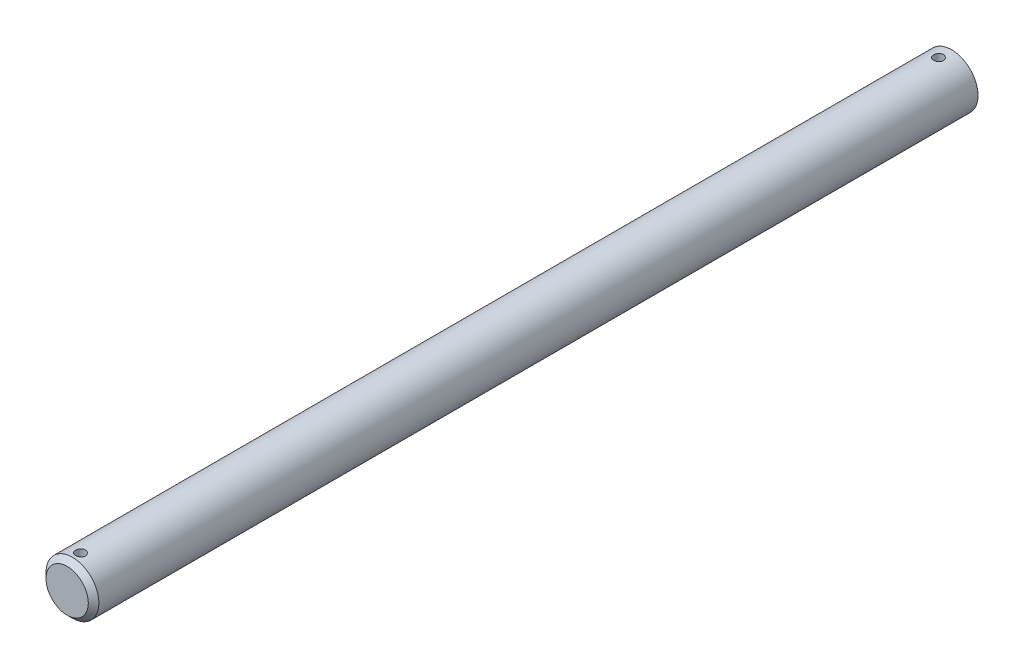
ISO-10303-21;
HEADER;
FILE_DESCRIPTION(('STEP AP214'),'2;1');
FILE_NAME('part.step','',(''),(''),'','','');
FILE_SCHEMA(('AUTOMOTIVE_DESIGN { 1 0 10303 214 1 1 1 1 }'));
ENDSEC;
DATA;
#1=APPLICATION_CONTEXT('core data for automotive mechanical design processes');
#2=APPLICATION_PROTOCOL_DEFINITION('international standard','automotive_design',2000,#1);
#3=PRODUCT_CONTEXT('',#1,'mechanical');
#4=PRODUCT('Part','Part','',(#3));
#5=PRODUCT_RELATED_PRODUCT_CATEGORY('part','',(#4));
#6=PRODUCT_DEFINITION_FORMATION('','',#4);
#7=PRODUCT_DEFINITION_CONTEXT('part definition',#1,'design');
#8=PRODUCT_DEFINITION('design','',#6,#7);
#9=PRODUCT_DEFINITION_SHAPE('','',#8);
#10=(LENGTH_UNIT() NAMED_UNIT(*) SI_UNIT(.MILLI.,.METRE.));
#11=(NAMED_UNIT(*) PLANE_ANGLE_UNIT() SI_UNIT($,.RADIAN.));
#12=(NAMED_UNIT(*) SI_UNIT($,.STERADIAN.) SOLID_ANGLE_UNIT());
#13=UNCERTAINTY_MEASURE_WITH_UNIT(LENGTH_MEASURE(1.E-05),#10,'distance_accuracy_value','');
#14=(GEOMETRIC_REPRESENTATION_CONTEXT(3) GLOBAL_UNCERTAINTY_ASSIGNED_CONTEXT((#13)) GLOBAL_UNIT_ASSIGNED_CONTEXT((#10,
#11,#12)) REPRESENTATION_CONTEXT('',''));
#15=CARTESIAN_POINT('',(0.,0.,0.));
#16=DIRECTION('',(0.,0.,1.));
#17=DIRECTION('',(1.,0.,0.));
#18=AXIS2_PLACEMENT_3D('',#15,#16,#17);
#19=CARTESIAN_POINT('',(0.,0.,304.8));
#20=DIRECTION('',(0.,0.,-1.));
#21=DIRECTION('',(-1.,0.,0.));
#22=AXIS2_PLACEMENT_3D('',#19,#20,#21);
#23=CYLINDRICAL_SURFACE('',#22,3.175);
#24=CARTESIAN_POINT('',(0.,-3.17500000000001,200.7631875));
#25=CARTESIAN_POINT('',(0.0331278493784853,-3.17499940005936,200.763186234132));
#26=CARTESIAN_POINT('',(0.0662721689897604,-3.17447616437681,200.760412916467));
#27=CARTESIAN_POINT('',(0.131626820280967,-3.17243930650301,200.749400064437));
#28=CARTESIAN_POINT('',(0.163836339741668,-3.17092484847488,200.741155916777));
#29=CARTESIAN_POINT('',(0.226366769234936,-3.16707495697542,200.719462709188));
#30=CARTESIAN_POINT('',(0.256689356240747,-3.16474026510011,200.706018349808));
#31=CARTESIAN_POINT('',(0.314645664321685,-3.1595048514429,200.674319695721));
#32=CARTESIAN_POINT('',(0.34227960280819,-3.1566041754851,200.656065790371));
#33=CARTESIAN_POINT('',(0.394407912259924,-3.15051811645857,200.615034154574));
#34=CARTESIAN_POINT('',(0.418865429028266,-3.14733001333615,200.592210001647));
#35=CARTESIAN_POINT('',(0.463627811849754,-3.14104860763278,200.542785624206));
#36=CARTESIAN_POINT('',(0.483932379579184,-3.13795531187579,200.516185128654));
#37=CARTESIAN_POINT('',(0.519965775954875,-3.13218731275362,200.459702708681));
#38=CARTESIAN_POINT('',(0.535657115316883,-3.12951611636079,200.42979647803));
#39=CARTESIAN_POINT('',(0.561778643443757,-3.12493308056008,200.367713899289));
#40=CARTESIAN_POINT('',(0.572209285923864,-3.1230211756692,200.335537747243));
#41=CARTESIAN_POINT('',(0.587395056092022,-3.120200569874,200.270223017731));
#42=CARTESIAN_POINT('',(0.592214454824662,-3.11928051754792,200.237099883297));
#43=CARTESIAN_POINT('',(0.596240425878415,-3.11851356370003,200.170503350404));
#44=CARTESIAN_POINT('',(0.595447501537275,-3.11866656594196,200.137029983624));
#45=CARTESIAN_POINT('',(0.588323450296884,-3.12001809916009,200.07114881341));
#46=CARTESIAN_POINT('',(0.582065407796812,-3.12120283233474,200.038732782137));
#47=CARTESIAN_POINT('',(0.564303860103709,-3.12446266491103,199.975419033399));
#48=CARTESIAN_POINT('',(0.552800132013026,-3.12653780214715,199.944521380514));
#49=CARTESIAN_POINT('',(0.524802287242858,-3.13135905069247,199.884907618022));
#50=CARTESIAN_POINT('',(0.508278659956945,-3.13410911079899,199.856205700738));
#51=CARTESIAN_POINT('',(0.470730932942593,-3.13996773104909,199.801954373361));
#52=CARTESIAN_POINT('',(0.449706376466774,-3.14307632756161,199.776405283626));
#53=CARTESIAN_POINT('',(0.403359563188527,-3.14936188004891,199.728762595718));
#54=CARTESIAN_POINT('',(0.377974795254092,-3.15253914125163,199.706729803558));
#55=CARTESIAN_POINT('',(0.323837314723613,-3.15855900111739,199.667226220107));
#56=CARTESIAN_POINT('',(0.295084568364023,-3.16140159642489,199.649755474555));
#57=CARTESIAN_POINT('',(0.234963886209646,-3.16643757934512,199.619862953933));
#58=CARTESIAN_POINT('',(0.203592733389712,-3.16863015282216,199.607447503288));
#59=CARTESIAN_POINT('',(0.139159898923862,-3.17211275581705,199.588079481804));
#60=CARTESIAN_POINT('',(0.106098397260247,-3.17340288121049,199.581126330645));
#61=CARTESIAN_POINT('',(0.039746496621029,-3.17492205629787,199.57296491894));
#62=CARTESIAN_POINT('',(0.00646668626417092,-3.17516649268312,199.571673344612));
#63=CARTESIAN_POINT('',(-0.0598333703365869,-3.17460925115548,199.574648268445));
#64=CARTESIAN_POINT('',(-0.0928536292531546,-3.1738076246401,199.578914493529));
#65=CARTESIAN_POINT('',(-0.157432999370982,-3.17125791126725,199.592814648338));
#66=CARTESIAN_POINT('',(-0.189001503602658,-3.16951726067194,199.602406421507));
#67=CARTESIAN_POINT('',(-0.250082300755401,-3.16528387378086,199.626639777378));
#68=CARTESIAN_POINT('',(-0.279594453904929,-3.16279108642312,199.64128170294));
#69=CARTESIAN_POINT('',(-0.336080366506806,-3.157291557982,199.675384132113));
#70=CARTESIAN_POINT('',(-0.363022863065379,-3.1542794982553,199.694895543107));
#71=CARTESIAN_POINT('',(-0.41328114704562,-3.1480892694748,199.738114198266));
#72=CARTESIAN_POINT('',(-0.436596595436346,-3.14491108492986,199.761821834222));
#73=CARTESIAN_POINT('',(-0.479255517992199,-3.13869576292426,199.813137139068));
#74=CARTESIAN_POINT('',(-0.498542136242492,-3.1356610588829,199.840792416662));
#75=CARTESIAN_POINT('',(-0.532196179135609,-3.1301252865148,199.898999182233));
#76=CARTESIAN_POINT('',(-0.546563786592775,-3.12762419835761,199.929550562522));
#77=CARTESIAN_POINT('',(-0.569891360504024,-3.12345793983175,199.992537953562));
#78=CARTESIAN_POINT('',(-0.578877385529314,-3.12178874798387,200.024964035013));
#79=CARTESIAN_POINT('',(-0.591267071076003,-3.11946609009084,200.090899991438));
#80=CARTESIAN_POINT('',(-0.59467136141813,-3.11881250944861,200.124409743701));
#81=CARTESIAN_POINT('',(-0.595779868526291,-3.11860088672157,200.190992306541));
#82=CARTESIAN_POINT('',(-0.593573770795143,-3.11902560714799,200.224063602442));
#83=CARTESIAN_POINT('',(-0.583720477284628,-3.12088450886938,200.289355033124));
#84=CARTESIAN_POINT('',(-0.576073314010793,-3.12231868413375,200.321575172988));
#85=CARTESIAN_POINT('',(-0.555592803846083,-3.126027641217,200.384201436153));
#86=CARTESIAN_POINT('',(-0.542769168607849,-3.12830084823628,200.41461083469));
#87=CARTESIAN_POINT('',(-0.512309542245318,-3.13343285059637,200.472860838402));
#88=CARTESIAN_POINT('',(-0.494673211138126,-3.13629168730423,200.50070126191));
#89=CARTESIAN_POINT('',(-0.454777027878795,-3.14232633736512,200.553472273017));
#90=CARTESIAN_POINT('',(-0.432451906336464,-3.1455062556199,200.578353054363));
#91=CARTESIAN_POINT('',(-0.383947958425851,-3.15179405961499,200.624045173853));
#92=CARTESIAN_POINT('',(-0.357768247938241,-3.15490192863972,200.644855575827));
#93=CARTESIAN_POINT('',(-0.302015900075403,-3.1607282796232,200.681991221824));
#94=CARTESIAN_POINT('',(-0.272414837535454,-3.1634430039313,200.698274398182));
#95=CARTESIAN_POINT('',(-0.210855763856358,-3.16814048941711,200.725610437028));
#96=CARTESIAN_POINT('',(-0.178899999270511,-3.17012393770744,200.736668212109));
#97=CARTESIAN_POINT('',(-0.122375296121224,-3.17273102874592,200.75099443416));
#98=CARTESIAN_POINT('',(-0.0981367934437042,-3.17357708754789,200.755559018905));
#99=CARTESIAN_POINT('',(-0.0492685574488248,-3.17471178919249,200.761655984027));
#100=CARTESIAN_POINT('',(-0.0246388340934171,-3.1750004462058,200.763188441489));
#101=CARTESIAN_POINT('',(0.,-3.17500000000001,200.7631875));
#102=B_SPLINE_CURVE_WITH_KNOTS('',3,(#24,#25,#26,#27,#28,#29,#30,#31,#32,#33,#34,#35,#36,#37,
#38,#39,#40,#41,#42,#43,#44,#45,#46,#47,#48,#49,#50,#51,#52,#53,#54,#55,#56,#57,#58,#59,#60,#61,
#62,#63,#64,#65,#66,#67,#68,#69,#70,#71,#72,#73,#74,#75,#76,#77,#78,#79,#80,#81,#82,#83,#84,#85,
#86,#87,#88,#89,#90,#91,#92,#93,#94,#95,#96,#97,#98,#99,#100,#101),.UNSPECIFIED.,.T.,.F.,(4,2,2,
2,2,2,2,2,2,2,2,2,2,2,2,2,2,2,2,2,2,2,2,2,2,2,2,2,2,2,2,2,2,2,2,2,2,2,4),(0.,0.0992934422579586,
0.198670720631257,0.297958379519772,0.397238003055783,0.497582499616606,0.597934201813106,
0.6990801935642,0.800217460363049,0.90018453854868,1.00014265136194,1.0987841586819,
1.19742985782943,1.29666707356096,1.39591436451039,1.4967258310918,1.59753830838151,
1.69847652240176,1.79940401117395,1.89884119086453,1.99827348496884,2.09692967832172,
2.19559257087284,2.2953336190078,2.3950839846395,2.4961589530434,2.59723016460248,
2.69780792915494,2.79837434413151,2.89734328229482,2.99631162921164,3.09509515682431,
3.19388566460124,3.29415524955411,3.39444786907212,3.49564344413667,3.59674369125815,
3.6705950548313,3.74444454087572),.UNSPECIFIED.);
#103=CARTESIAN_POINT('',(0.,-3.17500000000001,200.7631875));
#104=VERTEX_POINT('',#103);
#105=EDGE_CURVE('E10',#104,#104,#102,.T.);
#106=ORIENTED_EDGE('',*,*,#105,.T.);
#107=EDGE_LOOP('',(#106));
#108=FACE_BOUND('',#107,.T.);
#109=CARTESIAN_POINT('',(0.,3.17499999999999,200.7631875));
#110=CARTESIAN_POINT('',(-0.033127849378485,3.17499940005934,200.763186234132));
#111=CARTESIAN_POINT('',(-0.0662721689897601,3.1744761643768,200.760412916467));
#112=CARTESIAN_POINT('',(-0.131626820280967,3.17243930650299,200.749400064437));
#113=CARTESIAN_POINT('',(-0.163836339741668,3.17092484847486,200.741155916777));
#114=CARTESIAN_POINT('',(-0.226366769234936,3.1670749569754,200.719462709188));
#115=CARTESIAN_POINT('',(-0.256689356240747,3.16474026510009,200.706018349808));
#116=CARTESIAN_POINT('',(-0.314645664321685,3.15950485144288,200.674319695721));
#117=CARTESIAN_POINT('',(-0.34227960280819,3.15660417548508,200.656065790371));
#118=CARTESIAN_POINT('',(-0.394407912259924,3.15051811645855,200.615034154574));
#119=CARTESIAN_POINT('',(-0.418865429028265,3.14733001333613,200.592210001647));
#120=CARTESIAN_POINT('',(-0.463627811849754,3.14104860763276,200.542785624206));
#121=CARTESIAN_POINT('',(-0.483932379579183,3.13795531187577,200.516185128654));
#122=CARTESIAN_POINT('',(-0.519965775954875,3.1321873127536,200.459702708681));
#123=CARTESIAN_POINT('',(-0.535657115316883,3.12951611636077,200.42979647803));
#124=CARTESIAN_POINT('',(-0.561778643443757,3.12493308056006,200.367713899289));
#125=CARTESIAN_POINT('',(-0.572209285923864,3.12302117566918,200.335537747243));
#126=CARTESIAN_POINT('',(-0.587395056092022,3.12020056987398,200.270223017731));
#127=CARTESIAN_POINT('',(-0.592214454824662,3.11928051754791,200.237099883297));
#128=CARTESIAN_POINT('',(-0.596240425878415,3.11851356370001,200.170503350404));
#129=CARTESIAN_POINT('',(-0.595447501537275,3.11866656594194,200.137029983624));
#130=CARTESIAN_POINT('',(-0.588323450296884,3.12001809916007,200.07114881341));
#131=CARTESIAN_POINT('',(-0.582065407796812,3.12120283233472,200.038732782137));
#132=CARTESIAN_POINT('',(-0.564303860103709,3.12446266491101,199.975419033399));
#133=CARTESIAN_POINT('',(-0.552800132013025,3.12653780214713,199.944521380514));
#134=CARTESIAN_POINT('',(-0.524802287242858,3.13135905069245,199.884907618022));
#135=CARTESIAN_POINT('',(-0.508278659956945,3.13410911079897,199.856205700738));
#136=CARTESIAN_POINT('',(-0.470730932942593,3.13996773104907,199.801954373361));
#137=CARTESIAN_POINT('',(-0.449706376466774,3.14307632756159,199.776405283626));
#138=CARTESIAN_POINT('',(-0.403359563188527,3.14936188004889,199.728762595718));
#139=CARTESIAN_POINT('',(-0.377974795254092,3.15253914125161,199.706729803558));
#140=CARTESIAN_POINT('',(-0.323837314723612,3.15855900111738,199.667226220107));
#141=CARTESIAN_POINT('',(-0.295084568364023,3.16140159642487,199.649755474555));
#142=CARTESIAN_POINT('',(-0.234963886209645,3.1664375793451,199.619862953933));
#143=CARTESIAN_POINT('',(-0.203592733389711,3.16863015282214,199.607447503288));
#144=CARTESIAN_POINT('',(-0.139159898923861,3.17211275581703,199.588079481804));
#145=CARTESIAN_POINT('',(-0.106098397260247,3.17340288121047,199.581126330645));
#146=CARTESIAN_POINT('',(-0.0397464966210287,3.17492205629785,199.57296491894));
#147=CARTESIAN_POINT('',(-0.00646668626417062,3.1751664926831,199.571673344612));
#148=CARTESIAN_POINT('',(0.0598333703365872,3.17460925115546,199.574648268445));
#149=CARTESIAN_POINT('',(0.0928536292531549,3.17380762464008,199.578914493529));
#150=CARTESIAN_POINT('',(0.157432999370982,3.17125791126723,199.592814648338));
#151=CARTESIAN_POINT('',(0.189001503602659,3.16951726067192,199.602406421507));
#152=CARTESIAN_POINT('',(0.250082300755402,3.16528387378084,199.626639777378));
#153=CARTESIAN_POINT('',(0.27959445390493,3.1627910864231,199.64128170294));
#154=CARTESIAN_POINT('',(0.336080366506806,3.15729155798198,199.675384132113));
#155=CARTESIAN_POINT('',(0.363022863065379,3.15427949825529,199.694895543107));
#156=CARTESIAN_POINT('',(0.41328114704562,3.14808926947478,199.738114198266));
#157=CARTESIAN_POINT('',(0.436596595436346,3.14491108492984,199.761821834222));
#158=CARTESIAN_POINT('',(0.479255517992199,3.13869576292424,199.813137139068));
#159=CARTESIAN_POINT('',(0.498542136242492,3.13566105888288,199.840792416662));
#160=CARTESIAN_POINT('',(0.532196179135609,3.13012528651479,199.898999182233));
#161=CARTESIAN_POINT('',(0.546563786592775,3.12762419835759,199.929550562522));
#162=CARTESIAN_POINT('',(0.569891360504025,3.12345793983173,199.992537953562));
#163=CARTESIAN_POINT('',(0.578877385529314,3.12178874798385,200.024964035013));
#164=CARTESIAN_POINT('',(0.591267071076003,3.11946609009083,200.090899991438));
#165=CARTESIAN_POINT('',(0.594671361418131,3.11881250944859,200.124409743701));
#166=CARTESIAN_POINT('',(0.595779868526291,3.11860088672155,200.190992306541));
#167=CARTESIAN_POINT('',(0.593573770795142,3.11902560714797,200.224063602442));
#168=CARTESIAN_POINT('',(0.583720477284624,3.12088450886936,200.289355033124));
#169=CARTESIAN_POINT('',(0.57607331401079,3.12231868413373,200.321575172988));
#170=CARTESIAN_POINT('',(0.555592803846083,3.12602764121698,200.384201436153));
#171=CARTESIAN_POINT('',(0.54276916860785,3.12830084823626,200.41461083469));
#172=CARTESIAN_POINT('',(0.512309542245318,3.13343285059635,200.472860838402));
#173=CARTESIAN_POINT('',(0.494673211138126,3.13629168730421,200.50070126191));
#174=CARTESIAN_POINT('',(0.454777027878796,3.1423263373651,200.553472273017));
#175=CARTESIAN_POINT('',(0.432451906336464,3.14550625561988,200.578353054363));
#176=CARTESIAN_POINT('',(0.383947958425852,3.15179405961497,200.624045173853));
#177=CARTESIAN_POINT('',(0.357768247938242,3.1549019286397,200.644855575827));
#178=CARTESIAN_POINT('',(0.302015900075403,3.16072827962318,200.681991221824));
#179=CARTESIAN_POINT('',(0.272414837535455,3.16344300393128,200.698274398182));
#180=CARTESIAN_POINT('',(0.210855763856358,3.16814048941709,200.725610437028));
#181=CARTESIAN_POINT('',(0.178899999270511,3.17012393770742,200.736668212109));
#182=CARTESIAN_POINT('',(0.122375296121224,3.17273102874591,200.75099443416));
#183=CARTESIAN_POINT('',(0.0981367934437044,3.17357708754787,200.755559018905));
#184=CARTESIAN_POINT('',(0.0492685574488251,3.17471178919247,200.761655984027));
#185=CARTESIAN_POINT('',(0.0246388340934174,3.17500044620578,200.763188441489));
#186=CARTESIAN_POINT('',(0.,3.17499999999999,200.7631875));
#187=B_SPLINE_CURVE_WITH_KNOTS('',3,(#109,#110,#111,#112,#113,#114,#115,#116,#117,#118,#119,
#120,#121,#122,#123,#124,#125,#126,#127,#128,#129,#130,#131,#132,#133,#134,#135,#136,#137,#138,
#139,#140,#141,#142,#143,#144,#145,#146,#147,#148,#149,#150,#151,#152,#153,#154,#155,#156,#157,
#158,#159,#160,#161,#162,#163,#164,#165,#166,#167,#168,#169,#170,#171,#172,#173,#174,#175,#176,
#177,#178,#179,#180,#181,#182,#183,#184,#185,#186),.UNSPECIFIED.,.T.,.F.,(4,2,2,2,2,2,2,2,2,2,2,
2,2,2,2,2,2,2,2,2,2,2,2,2,2,2,2,2,2,2,2,2,2,2,2,2,2,2,4),(0.,0.0992934422579586,
0.198670720631257,0.297958379519772,0.397238003055783,0.497582499616606,0.597934201813106,
0.6990801935642,0.800217460363049,0.90018453854868,1.00014265136194,1.0987841586819,
1.19742985782943,1.29666707356096,1.39591436451039,1.4967258310918,1.59753830838151,
1.69847652240176,1.79940401117395,1.89884119086453,1.99827348496884,2.09692967832172,
2.19559257087284,2.2953336190078,2.3950839846395,2.4961589530434,2.59723016460248,
2.69780792915494,2.79837434413151,2.89734328229485,2.99631162921164,3.09509515682431,
3.19388566460124,3.29415524955411,3.39444786907212,3.49564344413667,3.59674369125815,
3.6705950548313,3.74444454087572),.UNSPECIFIED.);
#188=CARTESIAN_POINT('',(0.,3.17499999999999,200.7631875));
#189=VERTEX_POINT('',#188);
#190=EDGE_CURVE('E50',#189,#189,#187,.T.);
#191=ORIENTED_EDGE('',*,*,#190,.T.);
#192=EDGE_LOOP('',(#191));
#193=FACE_BOUND('',#192,.T.);
#194=CARTESIAN_POINT('',(0.,-3.17500000000001,303.8078125));
#195=CARTESIAN_POINT('',(0.0331278493784956,-3.17499940005936,303.807811234132));
#196=CARTESIAN_POINT('',(0.0662721689897699,-3.17447616437681,303.805037916467));
#197=CARTESIAN_POINT('',(0.131626820280976,-3.17243930650301,303.794025064437));
#198=CARTESIAN_POINT('',(0.163836339741677,-3.17092484847488,303.785780916777));
#199=CARTESIAN_POINT('',(0.226366769234958,-3.16707495697542,303.764087709188));
#200=CARTESIAN_POINT('',(0.256689356240781,-3.16474026510011,303.750643349808));
#201=CARTESIAN_POINT('',(0.314645664321714,-3.15950485144289,303.718944695721));
#202=CARTESIAN_POINT('',(0.342279602808203,-3.15660417548509,303.700690790371));
#203=CARTESIAN_POINT('',(0.394407912259931,-3.15051811645857,303.659659154574));
#204=CARTESIAN_POINT('',(0.41886542902828,-3.14733001333615,303.636835001646));
#205=CARTESIAN_POINT('',(0.463627811849776,-3.14104860763277,303.587410624206));
#206=CARTESIAN_POINT('',(0.483932379579207,-3.13795531187578,303.560810128654));
#207=CARTESIAN_POINT('',(0.519965775954901,-3.13218731275362,303.504327708681));
#208=CARTESIAN_POINT('',(0.535657115316909,-3.12951611636079,303.47442147803));
#209=CARTESIAN_POINT('',(0.561778643443776,-3.12493308056008,303.412338899289));
#210=CARTESIAN_POINT('',(0.572209285923881,-3.1230211756692,303.380162747243));
#211=CARTESIAN_POINT('',(0.587395056092034,-3.120200569874,303.314848017731));
#212=CARTESIAN_POINT('',(0.592214454824669,-3.11928051754792,303.281724883297));
#213=CARTESIAN_POINT('',(0.596240425878417,-3.11851356370003,303.215128350404));
#214=CARTESIAN_POINT('',(0.595447501537278,-3.11866656594196,303.181654983624));
#215=CARTESIAN_POINT('',(0.58832345029689,-3.12001809916009,303.11577381341));
#216=CARTESIAN_POINT('',(0.582065407796815,-3.12120283233474,303.083357782137));
#217=CARTESIAN_POINT('',(0.564303860103707,-3.12446266491103,303.020044033399));
#218=CARTESIAN_POINT('',(0.552800132013023,-3.12653780214715,302.989146380513));
#219=CARTESIAN_POINT('',(0.524802287242861,-3.13135905069247,302.929532618022));
#220=CARTESIAN_POINT('',(0.508278659956958,-3.13410911079899,302.900830700738));
#221=CARTESIAN_POINT('',(0.470730932942623,-3.13996773104909,302.846579373361));
#222=CARTESIAN_POINT('',(0.449706376466809,-3.14307632756161,302.821030283626));
#223=CARTESIAN_POINT('',(0.403359563188558,-3.14936188004891,302.773387595718));
#224=CARTESIAN_POINT('',(0.377974795254109,-3.15253914125163,302.751354803558));
#225=CARTESIAN_POINT('',(0.323837314723599,-3.1585590011174,302.711851220107));
#226=CARTESIAN_POINT('',(0.295084568363997,-3.16140159642489,302.694380474555));
#227=CARTESIAN_POINT('',(0.234963886209613,-3.16643757934512,302.664487953933));
#228=CARTESIAN_POINT('',(0.203592733389688,-3.16863015282216,302.652072503288));
#229=CARTESIAN_POINT('',(0.139159898923856,-3.17211275581705,302.632704481804));
#230=CARTESIAN_POINT('',(0.106098397260251,-3.17340288121049,302.625751330645));
#231=CARTESIAN_POINT('',(0.0397464966210445,-3.17492205629787,302.61758991894));
#232=CARTESIAN_POINT('',(0.00646668626418795,-3.17516649268312,302.616298344612));
#233=CARTESIAN_POINT('',(-0.0598333703365708,-3.17460925115548,302.619273268446));
#234=CARTESIAN_POINT('',(-0.0928536292531409,-3.1738076246401,302.623539493529));
#235=CARTESIAN_POINT('',(-0.157432999370963,-3.17125791126725,302.637439648338));
#236=CARTESIAN_POINT('',(-0.189001503602631,-3.16951726067195,302.647031421507));
#237=CARTESIAN_POINT('',(-0.250082300755378,-3.16528387378086,302.671264777378));
#238=CARTESIAN_POINT('',(-0.279594453904919,-3.16279108642312,302.68590670294));
#239=CARTESIAN_POINT('',(-0.33608036650679,-3.157291557982,302.720009132113));
#240=CARTESIAN_POINT('',(-0.363022863065345,-3.15427949825531,302.739520543107));
#241=CARTESIAN_POINT('',(-0.413281147045584,-3.14808926947481,302.782739198266));
#242=CARTESIAN_POINT('',(-0.436596595436325,-3.14491108492986,302.806446834222));
#243=CARTESIAN_POINT('',(-0.479255517992183,-3.13869576292427,302.857762139068));
#244=CARTESIAN_POINT('',(-0.498542136242465,-3.13566105888291,302.885417416662));
#245=CARTESIAN_POINT('',(-0.532196179135576,-3.13012528651481,302.943624182233));
#246=CARTESIAN_POINT('',(-0.546563786592745,-3.12762419835762,302.974175562522));
#247=CARTESIAN_POINT('',(-0.569891360503998,-3.12345793983176,303.037162953562));
#248=CARTESIAN_POINT('',(-0.578877385529289,-3.12178874798387,303.069589035013));
#249=CARTESIAN_POINT('',(-0.591267071075983,-3.11946609009085,303.135524991438));
#250=CARTESIAN_POINT('',(-0.594671361418111,-3.11881250944861,303.169034743701));
#251=CARTESIAN_POINT('',(-0.595779868526272,-3.11860088672157,303.235617306541));
#252=CARTESIAN_POINT('',(-0.593573770795127,-3.11902560714799,303.268688602442));
#253=CARTESIAN_POINT('',(-0.583720477284618,-3.12088450886938,303.333980033124));
#254=CARTESIAN_POINT('',(-0.57607331401078,-3.12231868413375,303.366200172988));
#255=CARTESIAN_POINT('',(-0.555592803846065,-3.12602764121701,303.428826436153));
#256=CARTESIAN_POINT('',(-0.542769168607834,-3.12830084823628,303.45923583469));
#257=CARTESIAN_POINT('',(-0.512309542245301,-3.13343285059638,303.517485838402));
#258=CARTESIAN_POINT('',(-0.4946732111381,-3.13629168730423,303.54532626191));
#259=CARTESIAN_POINT('',(-0.454777027878766,-3.14232633736512,303.598097273017));
#260=CARTESIAN_POINT('',(-0.432451906336444,-3.1455062556199,303.622978054363));
#261=CARTESIAN_POINT('',(-0.383947958425829,-3.15179405961499,303.668670173853));
#262=CARTESIAN_POINT('',(-0.357768247938207,-3.15490192863972,303.689480575826));
#263=CARTESIAN_POINT('',(-0.302015900075373,-3.16072827962321,303.726616221824));
#264=CARTESIAN_POINT('',(-0.272414837535442,-3.1634430039313,303.742899398182));
#265=CARTESIAN_POINT('',(-0.21085576385636,-3.16814048941711,303.770235437028));
#266=CARTESIAN_POINT('',(-0.178899999270509,-3.17012393770744,303.781293212109));
#267=CARTESIAN_POINT('',(-0.122375296121215,-3.17273102874592,303.79561943416));
#268=CARTESIAN_POINT('',(-0.0981367934436929,-3.17357708754789,303.800184018905));
#269=CARTESIAN_POINT('',(-0.0492685574488116,-3.17471178919249,303.806280984027));
#270=CARTESIAN_POINT('',(-0.0246388340934046,-3.1750004462058,303.807813441489));
#271=CARTESIAN_POINT('',(0.,-3.17500000000001,303.8078125));
#272=B_SPLINE_CURVE_WITH_KNOTS('',3,(#194,#195,#196,#197,#198,#199,#200,#201,#202,#203,#204,
#205,#206,#207,#208,#209,#210,#211,#212,#213,#214,#215,#216,#217,#218,#219,#220,#221,#222,#223,
#224,#225,#226,#227,#228,#229,#230,#231,#232,#233,#234,#235,#236,#237,#238,#239,#240,#241,#242,
#243,#244,#245,#246,#247,#248,#249,#250,#251,#252,#253,#254,#255,#256,#257,#258,#259,#260,#261,
#262,#263,#264,#265,#266,#267,#268,#269,#270,#271),.UNSPECIFIED.,.T.,.F.,(4,2,2,2,2,2,2,2,2,2,2,
2,2,2,2,2,2,2,2,2,2,2,2,2,2,2,2,2,2,2,2,2,2,2,2,2,2,2,4),(0.,0.0992934422579537,
0.198670720631256,0.297958379519797,0.397238003055775,0.497582499616633,0.597934201813132,
0.699080193564254,0.800217460363045,0.900184538548675,1.00014265136191,1.09878415868192,
1.19742985782948,1.29666707356095,1.39591436451032,1.49672583109181,1.59753830838155,
1.69847652240177,1.79940401117393,1.89884119086451,1.99827348496881,2.09692967832168,
2.1955925708728,2.29533361900778,2.39508398463947,2.49615895304333,2.59723016460242,
2.69780792915486,2.79837434413146,2.89734328229474,2.99631162921161,3.09509515682426,
3.19388566460124,3.29415524955408,3.39444786907209,3.49564344413663,3.5967436912581,
3.67059505483126,3.74444454087568),.UNSPECIFIED.);
#273=CARTESIAN_POINT('',(0.,-3.17500000000001,303.8078125));
#274=VERTEX_POINT('',#273);
#275=EDGE_CURVE('E57',#274,#274,#272,.T.);
#276=ORIENTED_EDGE('',*,*,#275,.T.);
#277=EDGE_LOOP('',(#276));
#278=FACE_BOUND('',#277,.T.);
#279=CARTESIAN_POINT('',(0.,3.17499999999999,303.8078125));
#280=CARTESIAN_POINT('',(-0.0331278493784698,3.17499940005934,303.807811234132));
#281=CARTESIAN_POINT('',(-0.0662721689897442,3.17447616437679,303.805037916467));
#282=CARTESIAN_POINT('',(-0.13162682028095,3.17243930650299,303.794025064437));
#283=CARTESIAN_POINT('',(-0.163836339741651,3.17092484847486,303.785780916777));
#284=CARTESIAN_POINT('',(-0.226366769234933,3.1670749569754,303.764087709188));
#285=CARTESIAN_POINT('',(-0.256689356240756,3.16474026510009,303.750643349808));
#286=CARTESIAN_POINT('',(-0.314645664321688,3.15950485144288,303.718944695721));
#287=CARTESIAN_POINT('',(-0.342279602808177,3.15660417548508,303.700690790371));
#288=CARTESIAN_POINT('',(-0.394407912259905,3.15051811645856,303.659659154574));
#289=CARTESIAN_POINT('',(-0.418865429028254,3.14733001333614,303.636835001646));
#290=CARTESIAN_POINT('',(-0.46362781184975,3.14104860763276,303.587410624206));
#291=CARTESIAN_POINT('',(-0.483932379579181,3.13795531187577,303.560810128654));
#292=CARTESIAN_POINT('',(-0.519965775954875,3.1321873127536,303.504327708681));
#293=CARTESIAN_POINT('',(-0.535657115316883,3.12951611636077,303.47442147803));
#294=CARTESIAN_POINT('',(-0.56177864344375,3.12493308056007,303.412338899289));
#295=CARTESIAN_POINT('',(-0.572209285923855,3.12302117566919,303.380162747243));
#296=CARTESIAN_POINT('',(-0.587395056092009,3.12020056987399,303.314848017731));
#297=CARTESIAN_POINT('',(-0.592214454824643,3.11928051754791,303.281724883297));
#298=CARTESIAN_POINT('',(-0.596240425878392,3.11851356370001,303.215128350404));
#299=CARTESIAN_POINT('',(-0.595447501537253,3.11866656594195,303.181654983624));
#300=CARTESIAN_POINT('',(-0.588323450296865,3.12001809916008,303.11577381341));
#301=CARTESIAN_POINT('',(-0.58206540779679,3.12120283233473,303.083357782137));
#302=CARTESIAN_POINT('',(-0.564303860103681,3.12446266491101,303.020044033399));
#303=CARTESIAN_POINT('',(-0.552800132012997,3.12653780214714,302.989146380513));
#304=CARTESIAN_POINT('',(-0.524802287242835,3.13135905069245,302.929532618022));
#305=CARTESIAN_POINT('',(-0.508278659956932,3.13410911079897,302.900830700738));
#306=CARTESIAN_POINT('',(-0.470730932942597,3.13996773104907,302.846579373361));
#307=CARTESIAN_POINT('',(-0.449706376466783,3.14307632756159,302.821030283626));
#308=CARTESIAN_POINT('',(-0.403359563188532,3.14936188004889,302.773387595718));
#309=CARTESIAN_POINT('',(-0.377974795254083,3.15253914125161,302.751354803558));
#310=CARTESIAN_POINT('',(-0.323837314723573,3.15855900111738,302.711851220107));
#311=CARTESIAN_POINT('',(-0.295084568363971,3.16140159642487,302.694380474555));
#312=CARTESIAN_POINT('',(-0.234963886209588,3.16643757934511,302.664487953933));
#313=CARTESIAN_POINT('',(-0.203592733389662,3.16863015282214,302.652072503288));
#314=CARTESIAN_POINT('',(-0.13915989892383,3.17211275581703,302.632704481804));
#315=CARTESIAN_POINT('',(-0.106098397260226,3.17340288121047,302.625751330645));
#316=CARTESIAN_POINT('',(-0.0397464966210191,3.17492205629785,302.61758991894));
#317=CARTESIAN_POINT('',(-0.00646668626416251,3.1751664926831,302.616298344612));
#318=CARTESIAN_POINT('',(0.0598333703365961,3.17460925115546,302.619273268446));
#319=CARTESIAN_POINT('',(0.0928536292531661,3.17380762464008,302.623539493529));
#320=CARTESIAN_POINT('',(0.157432999370988,3.17125791126723,302.637439648338));
#321=CARTESIAN_POINT('',(0.189001503602656,3.16951726067193,302.647031421507));
#322=CARTESIAN_POINT('',(0.250082300755404,3.16528387378084,302.671264777378));
#323=CARTESIAN_POINT('',(0.279594453904944,3.1627910864231,302.68590670294));
#324=CARTESIAN_POINT('',(0.336080366506815,3.15729155798198,302.720009132113));
#325=CARTESIAN_POINT('',(0.36302286306537,3.15427949825529,302.739520543107));
#326=CARTESIAN_POINT('',(0.413281147045609,3.14808926947478,302.782739198266));
#327=CARTESIAN_POINT('',(0.436596595436351,3.14491108492984,302.806446834222));
#328=CARTESIAN_POINT('',(0.479255517992208,3.13869576292424,302.857762139068));
#329=CARTESIAN_POINT('',(0.49854213624249,3.13566105888288,302.885417416662));
#330=CARTESIAN_POINT('',(0.532196179135601,3.13012528651479,302.943624182233));
#331=CARTESIAN_POINT('',(0.54656378659277,3.1276241983576,302.974175562522));
#332=CARTESIAN_POINT('',(0.569891360504023,3.12345793983173,303.037162953562));
#333=CARTESIAN_POINT('',(0.578877385529315,3.12178874798385,303.069589035013));
#334=CARTESIAN_POINT('',(0.591267071076009,3.11946609009082,303.135524991438));
#335=CARTESIAN_POINT('',(0.594671361418136,3.11881250944859,303.169034743701));
#336=CARTESIAN_POINT('',(0.595779868526297,3.11860088672155,303.235617306541));
#337=CARTESIAN_POINT('',(0.593573770795153,3.11902560714796,303.268688602442));
#338=CARTESIAN_POINT('',(0.583720477284644,3.12088450886935,303.333980033124));
#339=CARTESIAN_POINT('',(0.576073314010806,3.12231868413373,303.366200172988));
#340=CARTESIAN_POINT('',(0.555592803846091,3.12602764121698,303.428826436153));
#341=CARTESIAN_POINT('',(0.54276916860786,3.12830084823626,303.45923583469));
#342=CARTESIAN_POINT('',(0.512309542245326,3.13343285059635,303.517485838402));
#343=CARTESIAN_POINT('',(0.494673211138126,3.13629168730421,303.54532626191));
#344=CARTESIAN_POINT('',(0.454777027878792,3.1423263373651,303.598097273017));
#345=CARTESIAN_POINT('',(0.432451906336469,3.14550625561988,303.622978054363));
#346=CARTESIAN_POINT('',(0.383947958425855,3.15179405961497,303.668670173853));
#347=CARTESIAN_POINT('',(0.357768247938233,3.1549019286397,303.689480575826));
#348=CARTESIAN_POINT('',(0.302015900075392,3.16072827962318,303.726616221824));
#349=CARTESIAN_POINT('',(0.272414837535453,3.16344300393128,303.742899398182));
#350=CARTESIAN_POINT('',(0.210855763856371,3.16814048941709,303.770235437028));
#351=CARTESIAN_POINT('',(0.178899999270528,3.17012393770742,303.781293212109));
#352=CARTESIAN_POINT('',(0.122375296121242,3.1727310287459,303.79561943416));
#353=CARTESIAN_POINT('',(0.0981367934437188,3.17357708754787,303.800184018905));
#354=CARTESIAN_POINT('',(0.0492685574488371,3.17471178919247,303.806280984027));
#355=CARTESIAN_POINT('',(0.0246388340934303,3.17500044620578,303.807813441489));
#356=CARTESIAN_POINT('',(0.,3.17499999999999,303.8078125));
#357=B_SPLINE_CURVE_WITH_KNOTS('',3,(#279,#280,#281,#282,#283,#284,#285,#286,#287,#288,#289,
#290,#291,#292,#293,#294,#295,#296,#297,#298,#299,#300,#301,#302,#303,#304,#305,#306,#307,#308,
#309,#310,#311,#312,#313,#314,#315,#316,#317,#318,#319,#320,#321,#322,#323,#324,#325,#326,#327,
#328,#329,#330,#331,#332,#333,#334,#335,#336,#337,#338,#339,#340,#341,#342,#343,#344,#345,#346,
#347,#348,#349,#350,#351,#352,#353,#354,#355,#356),.UNSPECIFIED.,.T.,.F.,(4,2,2,2,2,2,2,2,2,2,2,
2,2,2,2,2,2,2,2,2,2,2,2,2,2,2,2,2,2,2,2,2,2,2,2,2,2,2,4),(0.,0.0992934422579536,
0.198670720631256,0.297958379519797,0.397238003055775,0.497582499616632,0.597934201813132,
0.699080193564254,0.800217460363045,0.900184538548675,1.00014265136191,1.09878415868192,
1.19742985782948,1.29666707356095,1.39591436451032,1.49672583109181,1.59753830838155,
1.69847652240177,1.79940401117393,1.89884119086451,1.99827348496881,2.09692967832168,
2.1955925708728,2.29533361900778,2.39508398463947,2.49615895304333,2.59723016460242,
2.69780792915486,2.79837434413146,2.89734328229474,2.99631162921161,3.09509515682425,
3.19388566460124,3.29415524955408,3.39444786907209,3.49564344413664,3.5967436912581,
3.67059505483125,3.74444454087568),.UNSPECIFIED.);
#358=CARTESIAN_POINT('',(0.,3.17499999999999,303.8078125));
#359=VERTEX_POINT('',#358);
#360=EDGE_CURVE('E63',#359,#359,#357,.T.);
#361=ORIENTED_EDGE('',*,*,#360,.T.);
#362=EDGE_LOOP('',(#361));
#363=FACE_BOUND('',#362,.T.);
#364=CARTESIAN_POINT('',(0.,0.,198.580375));
#365=DIRECTION('',(0.,0.,1.));
#366=DIRECTION('',(1.,0.,0.));
#367=AXIS2_PLACEMENT_3D('',#364,#365,#366);
#368=CIRCLE('',#367,3.175);
#369=CARTESIAN_POINT('',(3.175,0.,198.580375));
#370=VERTEX_POINT('',#369);
#371=EDGE_CURVE('E99',#370,#370,#368,.T.);
#372=ORIENTED_EDGE('',*,*,#371,.T.);
#373=EDGE_LOOP('',(#372));
#374=FACE_BOUND('',#373,.T.);
#375=CARTESIAN_POINT('',(0.,0.,304.165));
#376=DIRECTION('',(0.,0.,1.));
#377=DIRECTION('',(1.,0.,0.));
#378=AXIS2_PLACEMENT_3D('',#375,#376,#377);
#379=CIRCLE('',#378,3.175);
#380=CARTESIAN_POINT('',(3.175,0.,304.165));
#381=VERTEX_POINT('',#380);
#382=EDGE_CURVE('E96',#381,#381,#379,.F.);
#383=ORIENTED_EDGE('',*,*,#382,.T.);
#384=EDGE_LOOP('',(#383));
#385=FACE_BOUND('',#384,.T.);
#386=ADVANCED_FACE('F38',(#108,#193,#278,#363,#374,#385),#23,.T.);
#387=CARTESIAN_POINT('',(0.,0.,304.8));
#388=DIRECTION('',(0.,0.,1.));
#389=DIRECTION('',(1.,0.,0.));
#390=AXIS2_PLACEMENT_3D('',#387,#388,#389);
#391=PLANE('',#390);
#392=CARTESIAN_POINT('',(0.,0.,304.8));
#393=DIRECTION('',(0.,0.,1.));
#394=DIRECTION('',(1.,0.,0.));
#395=AXIS2_PLACEMENT_3D('',#392,#393,#394);
#396=CIRCLE('',#395,2.54000000000021);
#397=CARTESIAN_POINT('',(2.54000000000021,0.,304.8));
#398=VERTEX_POINT('',#397);
#399=EDGE_CURVE('E92',#398,#398,#396,.T.);
#400=ORIENTED_EDGE('',*,*,#399,.T.);
#401=EDGE_LOOP('',(#400));
#402=FACE_BOUND('',#401,.T.);
#403=ADVANCED_FACE('F109',(#402),#391,.T.);
#404=CARTESIAN_POINT('',(0.,0.,304.8));
#405=DIRECTION('',(0.,0.,-1.));
#406=DIRECTION('',(-1.,0.,0.));
#407=AXIS2_PLACEMENT_3D('',#404,#405,#406);
#408=CONICAL_SURFACE('',#407,2.54000000000021,0.785398163397418);
#409=ORIENTED_EDGE('',*,*,#382,.F.);
#410=EDGE_LOOP('',(#409));
#411=FACE_BOUND('',#410,.T.);
#412=ORIENTED_EDGE('',*,*,#399,.F.);
#413=EDGE_LOOP('',(#412));
#414=FACE_BOUND('',#413,.T.);
#415=ADVANCED_FACE('F40',(#411,#414),#408,.T.);
#416=CARTESIAN_POINT('',(0.,0.,198.580375));
#417=DIRECTION('',(0.,0.,1.));
#418=DIRECTION('',(1.,0.,0.));
#419=AXIS2_PLACEMENT_3D('',#416,#417,#418);
#420=PLANE('',#419);
#421=ORIENTED_EDGE('',*,*,#371,.F.);
#422=EDGE_LOOP('',(#421));
#423=FACE_BOUND('',#422,.T.);
#424=ADVANCED_FACE('F84',(#423),#420,.F.);
#425=CARTESIAN_POINT('',(0.,-3.17500000000001,303.2125));
#426=DIRECTION('',(0.,1.,0.));
#427=DIRECTION('',(0.,0.,1.));
#428=AXIS2_PLACEMENT_3D('',#425,#426,#427);
#429=CYLINDRICAL_SURFACE('',#428,0.595312500000002);
#430=ORIENTED_EDGE('',*,*,#360,.F.);
#431=EDGE_LOOP('',(#430));
#432=FACE_BOUND('',#431,.T.);
#433=ORIENTED_EDGE('',*,*,#275,.F.);
#434=EDGE_LOOP('',(#433));
#435=FACE_BOUND('',#434,.T.);
#436=ADVANCED_FACE('F78',(#432,#435),#429,.F.);
#437=CARTESIAN_POINT('',(0.,-3.17500000000001,200.167875));
#438=DIRECTION('',(0.,1.,0.));
#439=DIRECTION('',(0.,0.,1.));
#440=AXIS2_PLACEMENT_3D('',#437,#438,#439);
#441=CYLINDRICAL_SURFACE('',#440,0.595312500000008);
#442=ORIENTED_EDGE('',*,*,#190,.F.);
#443=EDGE_LOOP('',(#442));
#444=FACE_BOUND('',#443,.T.);
#445=ORIENTED_EDGE('',*,*,#105,.F.);
#446=EDGE_LOOP('',(#445));
#447=FACE_BOUND('',#446,.T.);
#448=ADVANCED_FACE('F75',(#444,#447),#441,.F.);
#449=CLOSED_SHELL('',(#386,#403,#415,#424,#436,#448));
#450=MANIFOLD_SOLID_BREP('B2',#449);
#451=ADVANCED_BREP_SHAPE_REPRESENTATION('',(#18,#450),#14);
#452=SHAPE_DEFINITION_REPRESENTATION(#9,#451);
ENDSEC;
END-ISO-10303-21;
